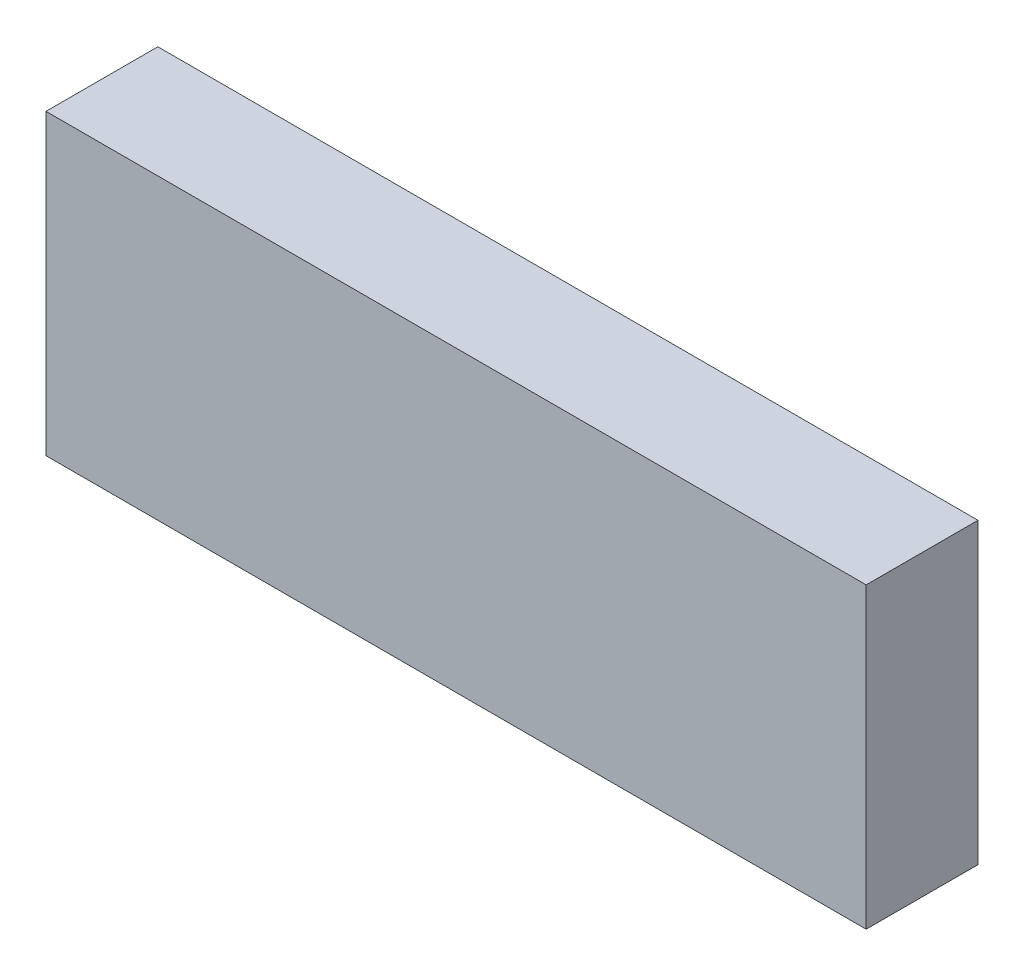
ISO-10303-21;
HEADER;
FILE_DESCRIPTION(('STEP AP214'),'2;1');
FILE_NAME('part.step','',(''),(''),'','','');
FILE_SCHEMA(('AUTOMOTIVE_DESIGN { 1 0 10303 214 1 1 1 1 }'));
ENDSEC;
DATA;
#1=APPLICATION_CONTEXT('core data for automotive mechanical design processes');
#2=APPLICATION_PROTOCOL_DEFINITION('international standard','automotive_design',2000,#1);
#3=PRODUCT_CONTEXT('',#1,'mechanical');
#4=PRODUCT('Part','Part','',(#3));
#5=PRODUCT_RELATED_PRODUCT_CATEGORY('part','',(#4));
#6=PRODUCT_DEFINITION_FORMATION('','',#4);
#7=PRODUCT_DEFINITION_CONTEXT('part definition',#1,'design');
#8=PRODUCT_DEFINITION('design','',#6,#7);
#9=PRODUCT_DEFINITION_SHAPE('','',#8);
#10=(LENGTH_UNIT() NAMED_UNIT(*) SI_UNIT(.MILLI.,.METRE.));
#11=(NAMED_UNIT(*) PLANE_ANGLE_UNIT() SI_UNIT($,.RADIAN.));
#12=(NAMED_UNIT(*) SI_UNIT($,.STERADIAN.) SOLID_ANGLE_UNIT());
#13=UNCERTAINTY_MEASURE_WITH_UNIT(LENGTH_MEASURE(1.E-05),#10,'distance_accuracy_value','');
#14=(GEOMETRIC_REPRESENTATION_CONTEXT(3) GLOBAL_UNCERTAINTY_ASSIGNED_CONTEXT((#13)) GLOBAL_UNIT_ASSIGNED_CONTEXT((#10,
#11,#12)) REPRESENTATION_CONTEXT('',''));
#15=CARTESIAN_POINT('',(0.,0.,0.));
#16=DIRECTION('',(0.,0.,1.));
#17=DIRECTION('',(1.,0.,0.));
#18=AXIS2_PLACEMENT_3D('',#15,#16,#17);
#19=CARTESIAN_POINT('',(15.,-0.500000000000001,3.));
#20=DIRECTION('',(-1.,0.,0.));
#21=DIRECTION('',(0.,0.,1.));
#22=AXIS2_PLACEMENT_3D('',#19,#20,#21);
#23=PLANE('',#22);
#24=DIRECTION('',(0.,1.,0.));
#25=VECTOR('',#24,1.);
#26=CARTESIAN_POINT('',(15.,-0.500000000000001,0.));
#27=LINE('',#26,#25);
#28=CARTESIAN_POINT('',(15.,-0.500000000000001,0.));
#29=VERTEX_POINT('',#28);
#30=CARTESIAN_POINT('',(15.,7.5,0.));
#31=VERTEX_POINT('',#30);
#32=EDGE_CURVE('E98',#29,#31,#27,.T.);
#33=ORIENTED_EDGE('',*,*,#32,.T.);
#34=DIRECTION('',(0.,0.,-1.));
#35=VECTOR('',#34,1.);
#36=CARTESIAN_POINT('',(15.,7.5,3.));
#37=LINE('',#36,#35);
#38=CARTESIAN_POINT('',(15.,7.5,3.));
#39=VERTEX_POINT('',#38);
#40=EDGE_CURVE('E11',#39,#31,#37,.T.);
#41=ORIENTED_EDGE('',*,*,#40,.F.);
#42=DIRECTION('',(0.,1.,0.));
#43=VECTOR('',#42,1.);
#44=CARTESIAN_POINT('',(15.,-0.500000000000001,3.));
#45=LINE('',#44,#43);
#46=CARTESIAN_POINT('',(15.,-0.500000000000001,3.));
#47=VERTEX_POINT('',#46);
#48=EDGE_CURVE('E86',#47,#39,#45,.T.);
#49=ORIENTED_EDGE('',*,*,#48,.F.);
#50=DIRECTION('',(0.,0.,-1.));
#51=VECTOR('',#50,1.);
#52=CARTESIAN_POINT('',(15.,-0.500000000000001,3.));
#53=LINE('',#52,#51);
#54=EDGE_CURVE('E94',#47,#29,#53,.T.);
#55=ORIENTED_EDGE('',*,*,#54,.T.);
#56=EDGE_LOOP('',(#33,#41,#49,#55));
#57=FACE_BOUND('',#56,.T.);
#58=ADVANCED_FACE('F35',(#57),#23,.F.);
#59=CARTESIAN_POINT('',(-7.,7.5,3.));
#60=DIRECTION('',(0.,-1.,0.));
#61=DIRECTION('',(0.,0.,-1.));
#62=AXIS2_PLACEMENT_3D('',#59,#60,#61);
#63=PLANE('',#62);
#64=DIRECTION('',(-1.,0.,0.));
#65=VECTOR('',#64,1.);
#66=CARTESIAN_POINT('',(-7.,7.5,0.));
#67=LINE('',#66,#65);
#68=CARTESIAN_POINT('',(-7.,7.5,0.));
#69=VERTEX_POINT('',#68);
#70=EDGE_CURVE('E90',#31,#69,#67,.T.);
#71=ORIENTED_EDGE('',*,*,#70,.T.);
#72=DIRECTION('',(0.,0.,-1.));
#73=VECTOR('',#72,1.);
#74=CARTESIAN_POINT('',(-7.,7.5,3.));
#75=LINE('',#74,#73);
#76=CARTESIAN_POINT('',(-7.,7.5,3.));
#77=VERTEX_POINT('',#76);
#78=EDGE_CURVE('E43',#77,#69,#75,.T.);
#79=ORIENTED_EDGE('',*,*,#78,.F.);
#80=DIRECTION('',(-1.,0.,0.));
#81=VECTOR('',#80,1.);
#82=CARTESIAN_POINT('',(-7.,7.5,3.));
#83=LINE('',#82,#81);
#84=EDGE_CURVE('E81',#39,#77,#83,.T.);
#85=ORIENTED_EDGE('',*,*,#84,.F.);
#86=ORIENTED_EDGE('',*,*,#40,.T.);
#87=EDGE_LOOP('',(#71,#79,#85,#86));
#88=FACE_BOUND('',#87,.T.);
#89=ADVANCED_FACE('F89',(#88),#63,.F.);
#90=CARTESIAN_POINT('',(-7.,-0.500000000000001,3.));
#91=DIRECTION('',(1.,0.,0.));
#92=DIRECTION('',(0.,0.,-1.));
#93=AXIS2_PLACEMENT_3D('',#90,#91,#92);
#94=PLANE('',#93);
#95=DIRECTION('',(0.,-1.,0.));
#96=VECTOR('',#95,1.);
#97=CARTESIAN_POINT('',(-7.,-0.500000000000001,0.));
#98=LINE('',#97,#96);
#99=CARTESIAN_POINT('',(-7.,-0.500000000000001,0.));
#100=VERTEX_POINT('',#99);
#101=EDGE_CURVE('E68',#69,#100,#98,.T.);
#102=ORIENTED_EDGE('',*,*,#101,.T.);
#103=DIRECTION('',(0.,0.,-1.));
#104=VECTOR('',#103,1.);
#105=CARTESIAN_POINT('',(-7.,-0.500000000000001,3.));
#106=LINE('',#105,#104);
#107=CARTESIAN_POINT('',(-7.,-0.500000000000001,3.));
#108=VERTEX_POINT('',#107);
#109=EDGE_CURVE('E91',#108,#100,#106,.T.);
#110=ORIENTED_EDGE('',*,*,#109,.F.);
#111=DIRECTION('',(0.,-1.,0.));
#112=VECTOR('',#111,1.);
#113=CARTESIAN_POINT('',(-7.,-0.500000000000001,3.));
#114=LINE('',#113,#112);
#115=EDGE_CURVE('E84',#77,#108,#114,.T.);
#116=ORIENTED_EDGE('',*,*,#115,.F.);
#117=ORIENTED_EDGE('',*,*,#78,.T.);
#118=EDGE_LOOP('',(#102,#110,#116,#117));
#119=FACE_BOUND('',#118,.T.);
#120=ADVANCED_FACE('F92',(#119),#94,.F.);
#121=CARTESIAN_POINT('',(-7.,-0.500000000000001,3.));
#122=DIRECTION('',(0.,1.,0.));
#123=DIRECTION('',(0.,0.,1.));
#124=AXIS2_PLACEMENT_3D('',#121,#122,#123);
#125=PLANE('',#124);
#126=DIRECTION('',(1.,0.,0.));
#127=VECTOR('',#126,1.);
#128=CARTESIAN_POINT('',(-7.,-0.500000000000001,0.));
#129=LINE('',#128,#127);
#130=EDGE_CURVE('E74',#100,#29,#129,.T.);
#131=ORIENTED_EDGE('',*,*,#130,.T.);
#132=ORIENTED_EDGE('',*,*,#54,.F.);
#133=DIRECTION('',(1.,0.,0.));
#134=VECTOR('',#133,1.);
#135=CARTESIAN_POINT('',(-7.,-0.500000000000001,3.));
#136=LINE('',#135,#134);
#137=EDGE_CURVE('E51',#108,#47,#136,.T.);
#138=ORIENTED_EDGE('',*,*,#137,.F.);
#139=ORIENTED_EDGE('',*,*,#109,.T.);
#140=EDGE_LOOP('',(#131,#132,#138,#139));
#141=FACE_BOUND('',#140,.T.);
#142=ADVANCED_FACE('F105',(#141),#125,.F.);
#143=CARTESIAN_POINT('',(0.,0.,3.));
#144=DIRECTION('',(0.,0.,-1.));
#145=DIRECTION('',(-1.,0.,0.));
#146=AXIS2_PLACEMENT_3D('',#143,#144,#145);
#147=PLANE('',#146);
#148=ORIENTED_EDGE('',*,*,#48,.T.);
#149=ORIENTED_EDGE('',*,*,#84,.T.);
#150=ORIENTED_EDGE('',*,*,#115,.T.);
#151=ORIENTED_EDGE('',*,*,#137,.T.);
#152=EDGE_LOOP('',(#148,#149,#150,#151));
#153=FACE_BOUND('',#152,.T.);
#154=ADVANCED_FACE('F82',(#153),#147,.F.);
#155=CARTESIAN_POINT('',(0.,0.,0.));
#156=DIRECTION('',(0.,0.,-1.));
#157=DIRECTION('',(-1.,0.,0.));
#158=AXIS2_PLACEMENT_3D('',#155,#156,#157);
#159=PLANE('',#158);
#160=ORIENTED_EDGE('',*,*,#32,.F.);
#161=ORIENTED_EDGE('',*,*,#130,.F.);
#162=ORIENTED_EDGE('',*,*,#101,.F.);
#163=ORIENTED_EDGE('',*,*,#70,.F.);
#164=EDGE_LOOP('',(#160,#161,#162,#163));
#165=FACE_BOUND('',#164,.T.);
#166=ADVANCED_FACE('F108',(#165),#159,.T.);
#167=CLOSED_SHELL('',(#58,#89,#120,#142,#154,#166));
#168=MANIFOLD_SOLID_BREP('B2',#167);
#169=ADVANCED_BREP_SHAPE_REPRESENTATION('',(#18,#168),#14);
#170=SHAPE_DEFINITION_REPRESENTATION(#9,#169);
ENDSEC;
END-ISO-10303-21;
